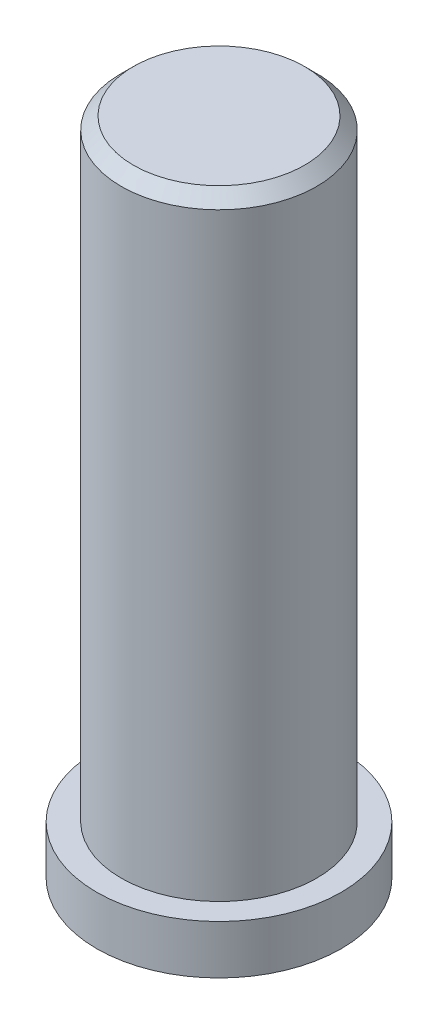
ISO-10303-21;
HEADER;
FILE_DESCRIPTION(('STEP AP214'),'2;1');
FILE_NAME('part.step','',(''),(''),'','','');
FILE_SCHEMA(('AUTOMOTIVE_DESIGN { 1 0 10303 214 1 1 1 1 }'));
ENDSEC;
DATA;
#1=APPLICATION_CONTEXT('core data for automotive mechanical design processes');
#2=APPLICATION_PROTOCOL_DEFINITION('international standard','automotive_design',2000,#1);
#3=PRODUCT_CONTEXT('',#1,'mechanical');
#4=PRODUCT('Part','Part','',(#3));
#5=PRODUCT_RELATED_PRODUCT_CATEGORY('part','',(#4));
#6=PRODUCT_DEFINITION_FORMATION('','',#4);
#7=PRODUCT_DEFINITION_CONTEXT('part definition',#1,'design');
#8=PRODUCT_DEFINITION('design','',#6,#7);
#9=PRODUCT_DEFINITION_SHAPE('','',#8);
#10=(LENGTH_UNIT() NAMED_UNIT(*) SI_UNIT(.MILLI.,.METRE.));
#11=(NAMED_UNIT(*) PLANE_ANGLE_UNIT() SI_UNIT($,.RADIAN.));
#12=(NAMED_UNIT(*) SI_UNIT($,.STERADIAN.) SOLID_ANGLE_UNIT());
#13=UNCERTAINTY_MEASURE_WITH_UNIT(LENGTH_MEASURE(1.E-05),#10,'distance_accuracy_value','');
#14=(GEOMETRIC_REPRESENTATION_CONTEXT(3) GLOBAL_UNCERTAINTY_ASSIGNED_CONTEXT((#13)) GLOBAL_UNIT_ASSIGNED_CONTEXT((#10,
#11,#12)) REPRESENTATION_CONTEXT('',''));
#15=CARTESIAN_POINT('',(0.,0.,0.));
#16=DIRECTION('',(0.,0.,1.));
#17=DIRECTION('',(1.,0.,0.));
#18=AXIS2_PLACEMENT_3D('',#15,#16,#17);
#19=CARTESIAN_POINT('',(0.,2.,0.));
#20=DIRECTION('',(0.,-1.,0.));
#21=DIRECTION('',(0.,0.,-1.));
#22=AXIS2_PLACEMENT_3D('',#19,#20,#21);
#23=CYLINDRICAL_SURFACE('',#22,5.);
#24=CARTESIAN_POINT('',(0.,2.,0.));
#25=DIRECTION('',(0.,1.,0.));
#26=DIRECTION('',(0.,0.,1.));
#27=AXIS2_PLACEMENT_3D('',#24,#25,#26);
#28=CIRCLE('',#27,5.);
#29=CARTESIAN_POINT('',(0.,2.,5.));
#30=VERTEX_POINT('',#29);
#31=EDGE_CURVE('E55',#30,#30,#28,.T.);
#32=ORIENTED_EDGE('',*,*,#31,.F.);
#33=EDGE_LOOP('',(#32));
#34=FACE_BOUND('',#33,.T.);
#35=CARTESIAN_POINT('',(0.,0.,0.));
#36=DIRECTION('',(0.,1.,0.));
#37=DIRECTION('',(0.,0.,1.));
#38=AXIS2_PLACEMENT_3D('',#35,#36,#37);
#39=CIRCLE('',#38,5.);
#40=CARTESIAN_POINT('',(0.,0.,5.));
#41=VERTEX_POINT('',#40);
#42=EDGE_CURVE('E58',#41,#41,#39,.T.);
#43=ORIENTED_EDGE('',*,*,#42,.T.);
#44=EDGE_LOOP('',(#43));
#45=FACE_BOUND('',#44,.T.);
#46=ADVANCED_FACE('F37',(#34,#45),#23,.T.);
#47=CARTESIAN_POINT('',(0.,2.,0.));
#48=DIRECTION('',(0.,1.,0.));
#49=DIRECTION('',(0.,0.,1.));
#50=AXIS2_PLACEMENT_3D('',#47,#48,#49);
#51=PLANE('',#50);
#52=CARTESIAN_POINT('',(0.,2.,0.));
#53=DIRECTION('',(0.,1.,0.));
#54=DIRECTION('',(0.,0.,1.));
#55=AXIS2_PLACEMENT_3D('',#52,#53,#54);
#56=CIRCLE('',#55,4.);
#57=CARTESIAN_POINT('',(0.,2.,4.));
#58=VERTEX_POINT('',#57);
#59=EDGE_CURVE('E50',#58,#58,#56,.T.);
#60=ORIENTED_EDGE('',*,*,#59,.F.);
#61=EDGE_LOOP('',(#60));
#62=FACE_BOUND('',#61,.T.);
#63=ORIENTED_EDGE('',*,*,#31,.T.);
#64=EDGE_LOOP('',(#63));
#65=FACE_BOUND('',#64,.T.);
#66=ADVANCED_FACE('F66',(#62,#65),#51,.T.);
#67=CARTESIAN_POINT('',(0.,0.,0.));
#68=DIRECTION('',(0.,1.,0.));
#69=DIRECTION('',(0.,0.,1.));
#70=AXIS2_PLACEMENT_3D('',#67,#68,#69);
#71=PLANE('',#70);
#72=ORIENTED_EDGE('',*,*,#42,.F.);
#73=EDGE_LOOP('',(#72));
#74=FACE_BOUND('',#73,.T.);
#75=ADVANCED_FACE('F72',(#74),#71,.F.);
#76=CARTESIAN_POINT('',(0.,27.,0.));
#77=DIRECTION('',(0.,-1.,0.));
#78=DIRECTION('',(0.,0.,-1.));
#79=AXIS2_PLACEMENT_3D('',#76,#77,#78);
#80=CYLINDRICAL_SURFACE('',#79,4.);
#81=CARTESIAN_POINT('',(0.,26.5,0.));
#82=DIRECTION('',(0.,1.,0.));
#83=DIRECTION('',(0.,0.,1.));
#84=AXIS2_PLACEMENT_3D('',#81,#82,#83);
#85=CIRCLE('',#84,4.);
#86=CARTESIAN_POINT('',(0.,26.5,4.));
#87=VERTEX_POINT('',#86);
#88=EDGE_CURVE('E10',#87,#87,#85,.F.);
#89=ORIENTED_EDGE('',*,*,#88,.T.);
#90=EDGE_LOOP('',(#89));
#91=FACE_BOUND('',#90,.T.);
#92=ORIENTED_EDGE('',*,*,#59,.T.);
#93=EDGE_LOOP('',(#92));
#94=FACE_BOUND('',#93,.T.);
#95=ADVANCED_FACE('F74',(#91,#94),#80,.T.);
#96=CARTESIAN_POINT('',(0.,27.,0.));
#97=DIRECTION('',(0.,1.,0.));
#98=DIRECTION('',(0.,0.,1.));
#99=AXIS2_PLACEMENT_3D('',#96,#97,#98);
#100=PLANE('',#99);
#101=CARTESIAN_POINT('',(0.,27.,0.));
#102=DIRECTION('',(0.,1.,0.));
#103=DIRECTION('',(0.,0.,1.));
#104=AXIS2_PLACEMENT_3D('',#101,#102,#103);
#105=CIRCLE('',#104,3.5);
#106=CARTESIAN_POINT('',(0.,27.,3.5));
#107=VERTEX_POINT('',#106);
#108=EDGE_CURVE('E45',#107,#107,#105,.T.);
#109=ORIENTED_EDGE('',*,*,#108,.T.);
#110=EDGE_LOOP('',(#109));
#111=FACE_BOUND('',#110,.T.);
#112=ADVANCED_FACE('F80',(#111),#100,.T.);
#113=CARTESIAN_POINT('',(0.,27.,0.));
#114=DIRECTION('',(0.,-1.,0.));
#115=DIRECTION('',(0.,0.,-1.));
#116=AXIS2_PLACEMENT_3D('',#113,#114,#115);
#117=CONICAL_SURFACE('',#116,3.5,0.785398163397448);
#118=ORIENTED_EDGE('',*,*,#88,.F.);
#119=EDGE_LOOP('',(#118));
#120=FACE_BOUND('',#119,.T.);
#121=ORIENTED_EDGE('',*,*,#108,.F.);
#122=EDGE_LOOP('',(#121));
#123=FACE_BOUND('',#122,.T.);
#124=ADVANCED_FACE('F39',(#120,#123),#117,.T.);
#125=CLOSED_SHELL('',(#46,#66,#75,#95,#112,#124));
#126=MANIFOLD_SOLID_BREP('B2',#125);
#127=ADVANCED_BREP_SHAPE_REPRESENTATION('',(#18,#126),#14);
#128=SHAPE_DEFINITION_REPRESENTATION(#9,#127);
ENDSEC;
END-ISO-10303-21;
